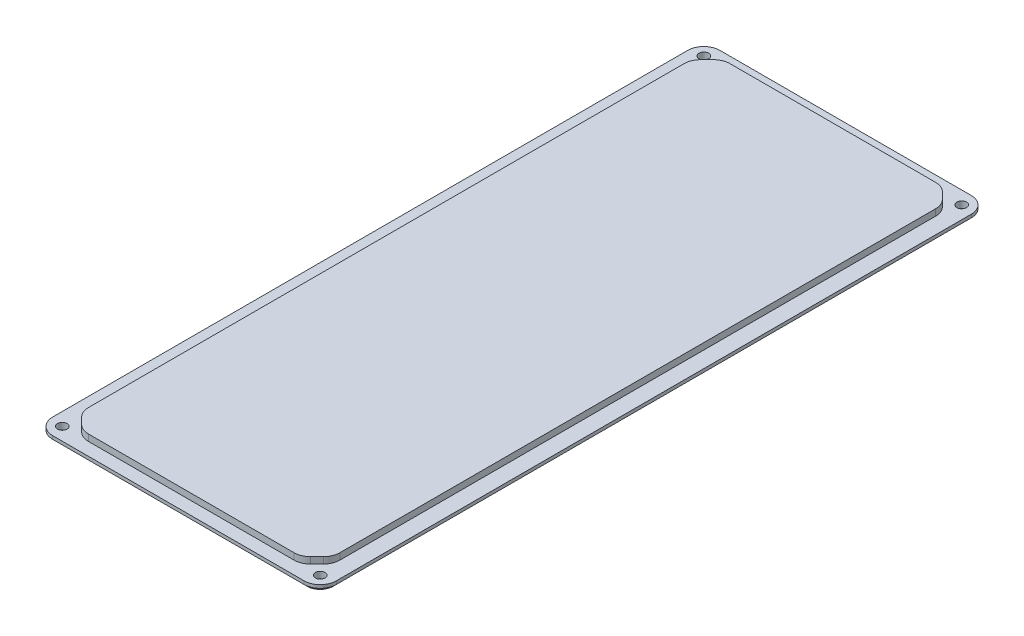
ISO-10303-21;
HEADER;
FILE_DESCRIPTION(('STEP AP214'),'2;1');
FILE_NAME('part.step','',(''),(''),'','','');
FILE_SCHEMA(('AUTOMOTIVE_DESIGN { 1 0 10303 214 1 1 1 1 }'));
ENDSEC;
DATA;
#1=APPLICATION_CONTEXT('core data for automotive mechanical design processes');
#2=APPLICATION_PROTOCOL_DEFINITION('international standard','automotive_design',2000,#1);
#3=PRODUCT_CONTEXT('',#1,'mechanical');
#4=PRODUCT('Part','Part','',(#3));
#5=PRODUCT_RELATED_PRODUCT_CATEGORY('part','',(#4));
#6=PRODUCT_DEFINITION_FORMATION('','',#4);
#7=PRODUCT_DEFINITION_CONTEXT('part definition',#1,'design');
#8=PRODUCT_DEFINITION('design','',#6,#7);
#9=PRODUCT_DEFINITION_SHAPE('','',#8);
#10=(LENGTH_UNIT() NAMED_UNIT(*) SI_UNIT(.MILLI.,.METRE.));
#11=(NAMED_UNIT(*) PLANE_ANGLE_UNIT() SI_UNIT($,.RADIAN.));
#12=(NAMED_UNIT(*) SI_UNIT($,.STERADIAN.) SOLID_ANGLE_UNIT());
#13=UNCERTAINTY_MEASURE_WITH_UNIT(LENGTH_MEASURE(1.E-05),#10,'distance_accuracy_value','');
#14=(GEOMETRIC_REPRESENTATION_CONTEXT(3) GLOBAL_UNCERTAINTY_ASSIGNED_CONTEXT((#13)) GLOBAL_UNIT_ASSIGNED_CONTEXT((#10,
#11,#12)) REPRESENTATION_CONTEXT('',''));
#15=CARTESIAN_POINT('',(0.,0.,0.));
#16=DIRECTION('',(0.,0.,1.));
#17=DIRECTION('',(1.,0.,0.));
#18=AXIS2_PLACEMENT_3D('',#15,#16,#17);
#19=CARTESIAN_POINT('',(0.,0.,0.));
#20=DIRECTION('',(0.,1.,0.));
#21=DIRECTION('',(0.,0.,1.));
#22=AXIS2_PLACEMENT_3D('',#19,#20,#21);
#23=PLANE('',#22);
#24=CARTESIAN_POINT('',(39.,0.,98.5));
#25=DIRECTION('',(0.,1.,0.));
#26=DIRECTION('',(0.,0.,1.));
#27=AXIS2_PLACEMENT_3D('',#24,#25,#26);
#28=CIRCLE('',#27,4.);
#29=CARTESIAN_POINT('',(43.,0.,98.5));
#30=VERTEX_POINT('',#29);
#31=CARTESIAN_POINT('',(39.,0.,102.5));
#32=VERTEX_POINT('',#31);
#33=EDGE_CURVE('E362',#30,#32,#28,.F.);
#34=ORIENTED_EDGE('',*,*,#33,.T.);
#35=DIRECTION('',(-1.,0.,0.));
#36=VECTOR('',#35,1.);
#37=CARTESIAN_POINT('',(0.,0.,102.5));
#38=LINE('',#37,#36);
#39=CARTESIAN_POINT('',(-39.,0.,102.5));
#40=VERTEX_POINT('',#39);
#41=EDGE_CURVE('E364',#32,#40,#38,.T.);
#42=ORIENTED_EDGE('',*,*,#41,.T.);
#43=CARTESIAN_POINT('',(-39.,0.,98.5));
#44=DIRECTION('',(0.,1.,0.));
#45=DIRECTION('',(0.,0.,1.));
#46=AXIS2_PLACEMENT_3D('',#43,#44,#45);
#47=CIRCLE('',#46,4.);
#48=CARTESIAN_POINT('',(-43.,0.,98.5));
#49=VERTEX_POINT('',#48);
#50=EDGE_CURVE('E360',#40,#49,#47,.F.);
#51=ORIENTED_EDGE('',*,*,#50,.T.);
#52=DIRECTION('',(0.,0.,-1.));
#53=VECTOR('',#52,1.);
#54=CARTESIAN_POINT('',(-43.,0.,0.));
#55=LINE('',#54,#53);
#56=CARTESIAN_POINT('',(-43.,0.,-98.5));
#57=VERTEX_POINT('',#56);
#58=EDGE_CURVE('E356',#49,#57,#55,.T.);
#59=ORIENTED_EDGE('',*,*,#58,.T.);
#60=CARTESIAN_POINT('',(-39.,0.,-98.5));
#61=DIRECTION('',(0.,1.,0.));
#62=DIRECTION('',(0.,0.,1.));
#63=AXIS2_PLACEMENT_3D('',#60,#61,#62);
#64=CIRCLE('',#63,4.);
#65=CARTESIAN_POINT('',(-39.,0.,-102.5));
#66=VERTEX_POINT('',#65);
#67=EDGE_CURVE('E352',#57,#66,#64,.F.);
#68=ORIENTED_EDGE('',*,*,#67,.T.);
#69=DIRECTION('',(1.,0.,0.));
#70=VECTOR('',#69,1.);
#71=CARTESIAN_POINT('',(0.,0.,-102.5));
#72=LINE('',#71,#70);
#73=CARTESIAN_POINT('',(39.,0.,-102.5));
#74=VERTEX_POINT('',#73);
#75=EDGE_CURVE('E350',#66,#74,#72,.T.);
#76=ORIENTED_EDGE('',*,*,#75,.T.);
#77=CARTESIAN_POINT('',(39.,0.,-98.5));
#78=DIRECTION('',(0.,1.,0.));
#79=DIRECTION('',(0.,0.,1.));
#80=AXIS2_PLACEMENT_3D('',#77,#78,#79);
#81=CIRCLE('',#80,4.);
#82=CARTESIAN_POINT('',(43.,0.,-98.5));
#83=VERTEX_POINT('',#82);
#84=EDGE_CURVE('E354',#74,#83,#81,.F.);
#85=ORIENTED_EDGE('',*,*,#84,.T.);
#86=DIRECTION('',(0.,0.,1.));
#87=VECTOR('',#86,1.);
#88=CARTESIAN_POINT('',(43.,0.,0.));
#89=LINE('',#88,#87);
#90=EDGE_CURVE('E358',#83,#30,#89,.T.);
#91=ORIENTED_EDGE('',*,*,#90,.T.);
#92=EDGE_LOOP('',(#34,#42,#51,#59,#68,#76,#85,#91));
#93=FACE_BOUND('',#92,.T.);
#94=CARTESIAN_POINT('',(-40.,0.,99.5));
#95=DIRECTION('',(0.,-1.,0.));
#96=DIRECTION('',(0.,0.,-1.));
#97=AXIS2_PLACEMENT_3D('',#94,#95,#96);
#98=CIRCLE('',#97,1.49999999999999);
#99=CARTESIAN_POINT('',(-40.,0.,98.));
#100=VERTEX_POINT('',#99);
#101=EDGE_CURVE('E416',#100,#100,#98,.T.);
#102=ORIENTED_EDGE('',*,*,#101,.F.);
#103=EDGE_LOOP('',(#102));
#104=FACE_BOUND('',#103,.T.);
#105=CARTESIAN_POINT('',(40.,0.,99.5));
#106=DIRECTION('',(0.,-1.,0.));
#107=DIRECTION('',(0.,0.,-1.));
#108=AXIS2_PLACEMENT_3D('',#105,#106,#107);
#109=CIRCLE('',#108,1.49999999999999);
#110=CARTESIAN_POINT('',(40.,0.,98.));
#111=VERTEX_POINT('',#110);
#112=EDGE_CURVE('E348',#111,#111,#109,.T.);
#113=ORIENTED_EDGE('',*,*,#112,.F.);
#114=EDGE_LOOP('',(#113));
#115=FACE_BOUND('',#114,.T.);
#116=CARTESIAN_POINT('',(-40.,0.,-99.5));
#117=DIRECTION('',(0.,-1.,0.));
#118=DIRECTION('',(0.,0.,-1.));
#119=AXIS2_PLACEMENT_3D('',#116,#117,#118);
#120=CIRCLE('',#119,1.49999999999999);
#121=CARTESIAN_POINT('',(-40.,0.,-101.));
#122=VERTEX_POINT('',#121);
#123=EDGE_CURVE('E408',#122,#122,#120,.T.);
#124=ORIENTED_EDGE('',*,*,#123,.F.);
#125=EDGE_LOOP('',(#124));
#126=FACE_BOUND('',#125,.T.);
#127=CARTESIAN_POINT('',(40.,0.,-99.5));
#128=DIRECTION('',(0.,-1.,0.));
#129=DIRECTION('',(0.,0.,-1.));
#130=AXIS2_PLACEMENT_3D('',#127,#128,#129);
#131=CIRCLE('',#130,1.49999999999999);
#132=CARTESIAN_POINT('',(40.,0.,-101.));
#133=VERTEX_POINT('',#132);
#134=EDGE_CURVE('E397',#133,#133,#131,.T.);
#135=ORIENTED_EDGE('',*,*,#134,.F.);
#136=EDGE_LOOP('',(#135));
#137=FACE_BOUND('',#136,.T.);
#138=ADVANCED_FACE('F33',(#93,#104,#115,#126,#137),#23,.F.);
#139=CARTESIAN_POINT('',(0.,2.,0.));
#140=DIRECTION('',(0.,1.,0.));
#141=DIRECTION('',(0.,0.,1.));
#142=AXIS2_PLACEMENT_3D('',#139,#140,#141);
#143=PLANE('',#142);
#144=CARTESIAN_POINT('',(40.,2.,-99.5));
#145=DIRECTION('',(0.,1.,0.));
#146=DIRECTION('',(0.,0.,1.));
#147=AXIS2_PLACEMENT_3D('',#144,#145,#146);
#148=CIRCLE('',#147,1.49999999999999);
#149=CARTESIAN_POINT('',(40.,2.,-98.));
#150=VERTEX_POINT('',#149);
#151=EDGE_CURVE('E403',#150,#150,#148,.T.);
#152=ORIENTED_EDGE('',*,*,#151,.F.);
#153=EDGE_LOOP('',(#152));
#154=FACE_BOUND('',#153,.T.);
#155=CARTESIAN_POINT('',(-40.,2.,-99.5));
#156=DIRECTION('',(0.,1.,0.));
#157=DIRECTION('',(0.,0.,1.));
#158=AXIS2_PLACEMENT_3D('',#155,#156,#157);
#159=CIRCLE('',#158,1.49999999999999);
#160=CARTESIAN_POINT('',(-40.,2.,-98.));
#161=VERTEX_POINT('',#160);
#162=EDGE_CURVE('E413',#161,#161,#159,.T.);
#163=ORIENTED_EDGE('',*,*,#162,.F.);
#164=EDGE_LOOP('',(#163));
#165=FACE_BOUND('',#164,.T.);
#166=CARTESIAN_POINT('',(-40.,2.,99.5));
#167=DIRECTION('',(0.,1.,0.));
#168=DIRECTION('',(0.,0.,1.));
#169=AXIS2_PLACEMENT_3D('',#166,#167,#168);
#170=CIRCLE('',#169,1.49999999999999);
#171=CARTESIAN_POINT('',(-40.,2.,101.));
#172=VERTEX_POINT('',#171);
#173=EDGE_CURVE('E419',#172,#172,#170,.T.);
#174=ORIENTED_EDGE('',*,*,#173,.F.);
#175=EDGE_LOOP('',(#174));
#176=FACE_BOUND('',#175,.T.);
#177=CARTESIAN_POINT('',(40.,2.,99.5));
#178=DIRECTION('',(0.,1.,0.));
#179=DIRECTION('',(0.,0.,1.));
#180=AXIS2_PLACEMENT_3D('',#177,#178,#179);
#181=CIRCLE('',#180,1.49999999999999);
#182=CARTESIAN_POINT('',(40.,2.,101.));
#183=VERTEX_POINT('',#182);
#184=EDGE_CURVE('E344',#183,#183,#181,.T.);
#185=ORIENTED_EDGE('',*,*,#184,.F.);
#186=EDGE_LOOP('',(#185));
#187=FACE_BOUND('',#186,.T.);
#188=DIRECTION('',(0.,0.,1.));
#189=VECTOR('',#188,1.);
#190=CARTESIAN_POINT('',(-44.,2.,-103.5));
#191=LINE('',#190,#189);
#192=CARTESIAN_POINT('',(-44.,2.,-98.5));
#193=VERTEX_POINT('',#192);
#194=CARTESIAN_POINT('',(-44.,2.,98.5));
#195=VERTEX_POINT('',#194);
#196=EDGE_CURVE('E228',#193,#195,#191,.T.);
#197=ORIENTED_EDGE('',*,*,#196,.T.);
#198=CARTESIAN_POINT('',(-39.,2.,98.5));
#199=DIRECTION('',(0.,1.,0.));
#200=DIRECTION('',(0.,0.,1.));
#201=AXIS2_PLACEMENT_3D('',#198,#199,#200);
#202=CIRCLE('',#201,5.);
#203=CARTESIAN_POINT('',(-39.,2.,103.5));
#204=VERTEX_POINT('',#203);
#205=EDGE_CURVE('E221',#195,#204,#202,.T.);
#206=ORIENTED_EDGE('',*,*,#205,.T.);
#207=DIRECTION('',(1.,0.,0.));
#208=VECTOR('',#207,1.);
#209=CARTESIAN_POINT('',(-44.,2.,103.5));
#210=LINE('',#209,#208);
#211=CARTESIAN_POINT('',(39.,2.,103.5));
#212=VERTEX_POINT('',#211);
#213=EDGE_CURVE('E225',#204,#212,#210,.T.);
#214=ORIENTED_EDGE('',*,*,#213,.T.);
#215=CARTESIAN_POINT('',(39.,2.,98.5));
#216=DIRECTION('',(0.,1.,0.));
#217=DIRECTION('',(0.,0.,1.));
#218=AXIS2_PLACEMENT_3D('',#215,#216,#217);
#219=CIRCLE('',#218,5.);
#220=CARTESIAN_POINT('',(44.,2.,98.5));
#221=VERTEX_POINT('',#220);
#222=EDGE_CURVE('E233',#212,#221,#219,.T.);
#223=ORIENTED_EDGE('',*,*,#222,.T.);
#224=DIRECTION('',(0.,0.,-1.));
#225=VECTOR('',#224,1.);
#226=CARTESIAN_POINT('',(44.,2.,-103.5));
#227=LINE('',#226,#225);
#228=CARTESIAN_POINT('',(44.,2.,-98.5));
#229=VERTEX_POINT('',#228);
#230=EDGE_CURVE('E437',#221,#229,#227,.T.);
#231=ORIENTED_EDGE('',*,*,#230,.T.);
#232=CARTESIAN_POINT('',(39.,2.,-98.5));
#233=DIRECTION('',(0.,1.,0.));
#234=DIRECTION('',(0.,0.,1.));
#235=AXIS2_PLACEMENT_3D('',#232,#233,#234);
#236=CIRCLE('',#235,5.);
#237=CARTESIAN_POINT('',(39.,2.,-103.5));
#238=VERTEX_POINT('',#237);
#239=EDGE_CURVE('E260',#229,#238,#236,.T.);
#240=ORIENTED_EDGE('',*,*,#239,.T.);
#241=DIRECTION('',(-1.,0.,0.));
#242=VECTOR('',#241,1.);
#243=CARTESIAN_POINT('',(-44.,2.,-103.5));
#244=LINE('',#243,#242);
#245=CARTESIAN_POINT('',(-39.,2.,-103.5));
#246=VERTEX_POINT('',#245);
#247=EDGE_CURVE('E450',#238,#246,#244,.T.);
#248=ORIENTED_EDGE('',*,*,#247,.T.);
#249=CARTESIAN_POINT('',(-39.,2.,-98.5));
#250=DIRECTION('',(0.,1.,0.));
#251=DIRECTION('',(0.,0.,1.));
#252=AXIS2_PLACEMENT_3D('',#249,#250,#251);
#253=CIRCLE('',#252,5.);
#254=EDGE_CURVE('E258',#246,#193,#253,.T.);
#255=ORIENTED_EDGE('',*,*,#254,.T.);
#256=EDGE_LOOP('',(#197,#206,#214,#223,#231,#240,#248,#255));
#257=FACE_BOUND('',#256,.T.);
#258=DIRECTION('',(-1.,0.,0.));
#259=VECTOR('',#258,1.);
#260=CARTESIAN_POINT('',(-39.,2.,-99.5));
#261=LINE('',#260,#259);
#262=CARTESIAN_POINT('',(31.9289321881346,2.,-99.5));
#263=VERTEX_POINT('',#262);
#264=CARTESIAN_POINT('',(-31.9289321881345,2.,-99.5));
#265=VERTEX_POINT('',#264);
#266=EDGE_CURVE('E440',#263,#265,#261,.T.);
#267=ORIENTED_EDGE('',*,*,#266,.F.);
#268=CARTESIAN_POINT('',(31.9289321881346,2.,-94.5));
#269=DIRECTION('',(0.,1.,0.));
#270=DIRECTION('',(0.,0.,1.));
#271=AXIS2_PLACEMENT_3D('',#268,#269,#270);
#272=CIRCLE('',#271,5.);
#273=CARTESIAN_POINT('',(35.4644660940673,2.,-98.0355339059327));
#274=VERTEX_POINT('',#273);
#275=EDGE_CURVE('E335',#263,#274,#272,.F.);
#276=ORIENTED_EDGE('',*,*,#275,.T.);
#277=DIRECTION('',(-0.707106781186546,0.,-0.707106781186549));
#278=VECTOR('',#277,1.);
#279=CARTESIAN_POINT('',(34.,2.,-99.5));
#280=LINE('',#279,#278);
#281=CARTESIAN_POINT('',(37.5355339059328,2.,-95.9644660940672));
#282=VERTEX_POINT('',#281);
#283=EDGE_CURVE('E468',#274,#282,#280,.F.);
#284=ORIENTED_EDGE('',*,*,#283,.T.);
#285=CARTESIAN_POINT('',(34.,2.,-92.4289321881345));
#286=DIRECTION('',(0.,1.,0.));
#287=DIRECTION('',(0.,0.,1.));
#288=AXIS2_PLACEMENT_3D('',#285,#286,#287);
#289=CIRCLE('',#288,5.);
#290=CARTESIAN_POINT('',(39.,2.,-92.4289321881345));
#291=VERTEX_POINT('',#290);
#292=EDGE_CURVE('E337',#282,#291,#289,.F.);
#293=ORIENTED_EDGE('',*,*,#292,.T.);
#294=DIRECTION('',(0.,0.,-1.));
#295=VECTOR('',#294,1.);
#296=CARTESIAN_POINT('',(39.,2.,-99.5));
#297=LINE('',#296,#295);
#298=CARTESIAN_POINT('',(39.,2.,92.4289321881345));
#299=VERTEX_POINT('',#298);
#300=EDGE_CURVE('E347',#299,#291,#297,.T.);
#301=ORIENTED_EDGE('',*,*,#300,.F.);
#302=CARTESIAN_POINT('',(34.,2.,92.4289321881345));
#303=DIRECTION('',(0.,1.,0.));
#304=DIRECTION('',(0.,0.,1.));
#305=AXIS2_PLACEMENT_3D('',#302,#303,#304);
#306=CIRCLE('',#305,5.);
#307=CARTESIAN_POINT('',(37.5355339059328,2.,95.9644660940673));
#308=VERTEX_POINT('',#307);
#309=EDGE_CURVE('E331',#299,#308,#306,.F.);
#310=ORIENTED_EDGE('',*,*,#309,.T.);
#311=DIRECTION('',(0.707106781186548,0.,-0.707106781186547));
#312=VECTOR('',#311,1.);
#313=CARTESIAN_POINT('',(39.,2.,94.5));
#314=LINE('',#313,#312);
#315=CARTESIAN_POINT('',(35.4644660940673,2.,98.0355339059327));
#316=VERTEX_POINT('',#315);
#317=EDGE_CURVE('E253',#308,#316,#314,.F.);
#318=ORIENTED_EDGE('',*,*,#317,.T.);
#319=CARTESIAN_POINT('',(31.9289321881345,2.,94.5));
#320=DIRECTION('',(0.,1.,0.));
#321=DIRECTION('',(0.,0.,1.));
#322=AXIS2_PLACEMENT_3D('',#319,#320,#321);
#323=CIRCLE('',#322,5.);
#324=CARTESIAN_POINT('',(31.9289321881345,2.,99.5));
#325=VERTEX_POINT('',#324);
#326=EDGE_CURVE('E333',#316,#325,#323,.F.);
#327=ORIENTED_EDGE('',*,*,#326,.T.);
#328=DIRECTION('',(1.,0.,0.));
#329=VECTOR('',#328,1.);
#330=CARTESIAN_POINT('',(-39.,2.,99.5));
#331=LINE('',#330,#329);
#332=CARTESIAN_POINT('',(-31.9289321881345,2.,99.5));
#333=VERTEX_POINT('',#332);
#334=EDGE_CURVE('E428',#333,#325,#331,.T.);
#335=ORIENTED_EDGE('',*,*,#334,.F.);
#336=CARTESIAN_POINT('',(-31.9289321881345,2.,94.5));
#337=DIRECTION('',(0.,1.,0.));
#338=DIRECTION('',(0.,0.,1.));
#339=AXIS2_PLACEMENT_3D('',#336,#337,#338);
#340=CIRCLE('',#339,5.);
#341=CARTESIAN_POINT('',(-35.4644660940673,2.,98.0355339059327));
#342=VERTEX_POINT('',#341);
#343=EDGE_CURVE('E329',#333,#342,#340,.F.);
#344=ORIENTED_EDGE('',*,*,#343,.T.);
#345=DIRECTION('',(0.707106781186546,0.,0.707106781186549));
#346=VECTOR('',#345,1.);
#347=CARTESIAN_POINT('',(-34.,2.,99.5));
#348=LINE('',#347,#346);
#349=CARTESIAN_POINT('',(-37.5355339059328,2.,95.9644660940672));
#350=VERTEX_POINT('',#349);
#351=EDGE_CURVE('E471',#342,#350,#348,.F.);
#352=ORIENTED_EDGE('',*,*,#351,.T.);
#353=CARTESIAN_POINT('',(-34.,2.,92.4289321881345));
#354=DIRECTION('',(0.,1.,0.));
#355=DIRECTION('',(0.,0.,1.));
#356=AXIS2_PLACEMENT_3D('',#353,#354,#355);
#357=CIRCLE('',#356,5.);
#358=CARTESIAN_POINT('',(-39.,2.,92.4289321881345));
#359=VERTEX_POINT('',#358);
#360=EDGE_CURVE('E327',#350,#359,#357,.F.);
#361=ORIENTED_EDGE('',*,*,#360,.T.);
#362=DIRECTION('',(0.,0.,1.));
#363=VECTOR('',#362,1.);
#364=CARTESIAN_POINT('',(-39.,2.,-99.5));
#365=LINE('',#364,#363);
#366=CARTESIAN_POINT('',(-39.,2.,-92.4289321881345));
#367=VERTEX_POINT('',#366);
#368=EDGE_CURVE('E443',#367,#359,#365,.T.);
#369=ORIENTED_EDGE('',*,*,#368,.F.);
#370=CARTESIAN_POINT('',(-34.,2.,-92.4289321881345));
#371=DIRECTION('',(0.,1.,0.));
#372=DIRECTION('',(0.,0.,1.));
#373=AXIS2_PLACEMENT_3D('',#370,#371,#372);
#374=CIRCLE('',#373,5.);
#375=CARTESIAN_POINT('',(-37.5355339059328,2.,-95.9644660940673));
#376=VERTEX_POINT('',#375);
#377=EDGE_CURVE('E341',#367,#376,#374,.F.);
#378=ORIENTED_EDGE('',*,*,#377,.T.);
#379=DIRECTION('',(-0.707106781186548,0.,0.707106781186548));
#380=VECTOR('',#379,1.);
#381=CARTESIAN_POINT('',(-39.,2.,-94.5));
#382=LINE('',#381,#380);
#383=CARTESIAN_POINT('',(-35.4644660940673,2.,-98.0355339059327));
#384=VERTEX_POINT('',#383);
#385=EDGE_CURVE('E465',#376,#384,#382,.F.);
#386=ORIENTED_EDGE('',*,*,#385,.T.);
#387=CARTESIAN_POINT('',(-31.9289321881345,2.,-94.5));
#388=DIRECTION('',(0.,1.,0.));
#389=DIRECTION('',(0.,0.,1.));
#390=AXIS2_PLACEMENT_3D('',#387,#388,#389);
#391=CIRCLE('',#390,5.);
#392=EDGE_CURVE('E339',#384,#265,#391,.F.);
#393=ORIENTED_EDGE('',*,*,#392,.T.);
#394=EDGE_LOOP('',(#267,#276,#284,#293,#301,#310,#318,#327,#335,#344,#352,#361,#369,#378,#386,#393));
#395=FACE_BOUND('',#394,.T.);
#396=ADVANCED_FACE('F223',(#154,#165,#176,#187,#257,#395),#143,.T.);
#397=CARTESIAN_POINT('',(44.,2.,-103.5));
#398=DIRECTION('',(-1.,0.,0.));
#399=DIRECTION('',(0.,0.,1.));
#400=AXIS2_PLACEMENT_3D('',#397,#398,#399);
#401=PLANE('',#400);
#402=DIRECTION('',(0.,-1.,0.));
#403=VECTOR('',#402,1.);
#404=CARTESIAN_POINT('',(44.,2.,98.5));
#405=LINE('',#404,#403);
#406=CARTESIAN_POINT('',(44.,1.,98.5));
#407=VERTEX_POINT('',#406);
#408=EDGE_CURVE('E296',#221,#407,#405,.T.);
#409=ORIENTED_EDGE('',*,*,#408,.T.);
#410=DIRECTION('',(0.,0.,-1.));
#411=VECTOR('',#410,1.);
#412=CARTESIAN_POINT('',(44.,1.,-103.5));
#413=LINE('',#412,#411);
#414=CARTESIAN_POINT('',(44.,1.,-98.5));
#415=VERTEX_POINT('',#414);
#416=EDGE_CURVE('E370',#407,#415,#413,.T.);
#417=ORIENTED_EDGE('',*,*,#416,.T.);
#418=DIRECTION('',(0.,-1.,0.));
#419=VECTOR('',#418,1.);
#420=CARTESIAN_POINT('',(44.,2.,-98.5));
#421=LINE('',#420,#419);
#422=EDGE_CURVE('E294',#415,#229,#421,.F.);
#423=ORIENTED_EDGE('',*,*,#422,.T.);
#424=ORIENTED_EDGE('',*,*,#230,.F.);
#425=EDGE_LOOP('',(#409,#417,#423,#424));
#426=FACE_BOUND('',#425,.T.);
#427=ADVANCED_FACE('F562',(#426),#401,.F.);
#428=CARTESIAN_POINT('',(-44.,2.,-103.5));
#429=DIRECTION('',(0.,0.,1.));
#430=DIRECTION('',(1.,0.,0.));
#431=AXIS2_PLACEMENT_3D('',#428,#429,#430);
#432=PLANE('',#431);
#433=DIRECTION('',(0.,-1.,0.));
#434=VECTOR('',#433,1.);
#435=CARTESIAN_POINT('',(39.,2.,-103.5));
#436=LINE('',#435,#434);
#437=CARTESIAN_POINT('',(39.,1.,-103.5));
#438=VERTEX_POINT('',#437);
#439=EDGE_CURVE('E311',#238,#438,#436,.T.);
#440=ORIENTED_EDGE('',*,*,#439,.T.);
#441=DIRECTION('',(-1.,0.,0.));
#442=VECTOR('',#441,1.);
#443=CARTESIAN_POINT('',(-44.,1.,-103.5));
#444=LINE('',#443,#442);
#445=CARTESIAN_POINT('',(-39.,1.,-103.5));
#446=VERTEX_POINT('',#445);
#447=EDGE_CURVE('E11',#438,#446,#444,.T.);
#448=ORIENTED_EDGE('',*,*,#447,.T.);
#449=DIRECTION('',(0.,-1.,0.));
#450=VECTOR('',#449,1.);
#451=CARTESIAN_POINT('',(-39.,2.,-103.5));
#452=LINE('',#451,#450);
#453=EDGE_CURVE('E309',#446,#246,#452,.F.);
#454=ORIENTED_EDGE('',*,*,#453,.T.);
#455=ORIENTED_EDGE('',*,*,#247,.F.);
#456=EDGE_LOOP('',(#440,#448,#454,#455));
#457=FACE_BOUND('',#456,.T.);
#458=ADVANCED_FACE('F573',(#457),#432,.F.);
#459=CARTESIAN_POINT('',(-44.,2.,-103.5));
#460=DIRECTION('',(1.,0.,0.));
#461=DIRECTION('',(0.,0.,-1.));
#462=AXIS2_PLACEMENT_3D('',#459,#460,#461);
#463=PLANE('',#462);
#464=DIRECTION('',(0.,-1.,0.));
#465=VECTOR('',#464,1.);
#466=CARTESIAN_POINT('',(-44.,2.,-98.5));
#467=LINE('',#466,#465);
#468=CARTESIAN_POINT('',(-44.,1.,-98.5));
#469=VERTEX_POINT('',#468);
#470=EDGE_CURVE('E248',#193,#469,#467,.T.);
#471=ORIENTED_EDGE('',*,*,#470,.T.);
#472=DIRECTION('',(0.,0.,1.));
#473=VECTOR('',#472,1.);
#474=CARTESIAN_POINT('',(-44.,1.,-103.5));
#475=LINE('',#474,#473);
#476=CARTESIAN_POINT('',(-44.,1.,98.5));
#477=VERTEX_POINT('',#476);
#478=EDGE_CURVE('E372',#469,#477,#475,.T.);
#479=ORIENTED_EDGE('',*,*,#478,.T.);
#480=DIRECTION('',(0.,-1.,0.));
#481=VECTOR('',#480,1.);
#482=CARTESIAN_POINT('',(-44.,2.,98.5));
#483=LINE('',#482,#481);
#484=EDGE_CURVE('E251',#477,#195,#483,.F.);
#485=ORIENTED_EDGE('',*,*,#484,.T.);
#486=ORIENTED_EDGE('',*,*,#196,.F.);
#487=EDGE_LOOP('',(#471,#479,#485,#486));
#488=FACE_BOUND('',#487,.T.);
#489=ADVANCED_FACE('F570',(#488),#463,.F.);
#490=CARTESIAN_POINT('',(-44.,2.,103.5));
#491=DIRECTION('',(0.,0.,-1.));
#492=DIRECTION('',(-1.,0.,0.));
#493=AXIS2_PLACEMENT_3D('',#490,#491,#492);
#494=PLANE('',#493);
#495=DIRECTION('',(0.,-1.,0.));
#496=VECTOR('',#495,1.);
#497=CARTESIAN_POINT('',(-39.,2.,103.5));
#498=LINE('',#497,#496);
#499=CARTESIAN_POINT('',(-39.,1.,103.5));
#500=VERTEX_POINT('',#499);
#501=EDGE_CURVE('E239',#204,#500,#498,.T.);
#502=ORIENTED_EDGE('',*,*,#501,.T.);
#503=DIRECTION('',(1.,0.,0.));
#504=VECTOR('',#503,1.);
#505=CARTESIAN_POINT('',(-44.,1.,103.5));
#506=LINE('',#505,#504);
#507=CARTESIAN_POINT('',(39.,1.,103.5));
#508=VERTEX_POINT('',#507);
#509=EDGE_CURVE('E343',#500,#508,#506,.T.);
#510=ORIENTED_EDGE('',*,*,#509,.T.);
#511=DIRECTION('',(0.,-1.,0.));
#512=VECTOR('',#511,1.);
#513=CARTESIAN_POINT('',(39.,2.,103.5));
#514=LINE('',#513,#512);
#515=EDGE_CURVE('E242',#508,#212,#514,.F.);
#516=ORIENTED_EDGE('',*,*,#515,.T.);
#517=ORIENTED_EDGE('',*,*,#213,.F.);
#518=EDGE_LOOP('',(#502,#510,#516,#517));
#519=FACE_BOUND('',#518,.T.);
#520=ADVANCED_FACE('F237',(#519),#494,.F.);
#521=CARTESIAN_POINT('',(39.,4.,-99.5));
#522=DIRECTION('',(-1.,0.,0.));
#523=DIRECTION('',(0.,0.,1.));
#524=AXIS2_PLACEMENT_3D('',#521,#522,#523);
#525=PLANE('',#524);
#526=DIRECTION('',(0.,0.,-1.));
#527=VECTOR('',#526,1.);
#528=CARTESIAN_POINT('',(39.,4.,-99.5));
#529=LINE('',#528,#527);
#530=CARTESIAN_POINT('',(39.,4.,92.4289321881345));
#531=VERTEX_POINT('',#530);
#532=CARTESIAN_POINT('',(39.,4.,-92.4289321881345));
#533=VERTEX_POINT('',#532);
#534=EDGE_CURVE('E424',#531,#533,#529,.T.);
#535=ORIENTED_EDGE('',*,*,#534,.F.);
#536=DIRECTION('',(0.,1.,0.));
#537=VECTOR('',#536,1.);
#538=CARTESIAN_POINT('',(39.,2.,92.4289321881345));
#539=LINE('',#538,#537);
#540=EDGE_CURVE('E302',#531,#299,#539,.F.);
#541=ORIENTED_EDGE('',*,*,#540,.T.);
#542=ORIENTED_EDGE('',*,*,#300,.T.);
#543=DIRECTION('',(0.,-1.,0.));
#544=VECTOR('',#543,1.);
#545=CARTESIAN_POINT('',(39.,4.,-92.4289321881345));
#546=LINE('',#545,#544);
#547=EDGE_CURVE('E299',#291,#533,#546,.F.);
#548=ORIENTED_EDGE('',*,*,#547,.T.);
#549=EDGE_LOOP('',(#535,#541,#542,#548));
#550=FACE_BOUND('',#549,.T.);
#551=ADVANCED_FACE('F542',(#550),#525,.F.);
#552=CARTESIAN_POINT('',(-39.,4.,-99.5));
#553=DIRECTION('',(0.,0.,1.));
#554=DIRECTION('',(1.,0.,0.));
#555=AXIS2_PLACEMENT_3D('',#552,#553,#554);
#556=PLANE('',#555);
#557=DIRECTION('',(-1.,0.,0.));
#558=VECTOR('',#557,1.);
#559=CARTESIAN_POINT('',(-39.,4.,-99.5));
#560=LINE('',#559,#558);
#561=CARTESIAN_POINT('',(31.9289321881346,4.,-99.5));
#562=VERTEX_POINT('',#561);
#563=CARTESIAN_POINT('',(-31.9289321881345,4.,-99.5));
#564=VERTEX_POINT('',#563);
#565=EDGE_CURVE('E427',#562,#564,#560,.T.);
#566=ORIENTED_EDGE('',*,*,#565,.F.);
#567=DIRECTION('',(0.,1.,0.));
#568=VECTOR('',#567,1.);
#569=CARTESIAN_POINT('',(31.9289321881346,2.,-99.5));
#570=LINE('',#569,#568);
#571=EDGE_CURVE('E316',#562,#263,#570,.F.);
#572=ORIENTED_EDGE('',*,*,#571,.T.);
#573=ORIENTED_EDGE('',*,*,#266,.T.);
#574=DIRECTION('',(0.,-1.,0.));
#575=VECTOR('',#574,1.);
#576=CARTESIAN_POINT('',(-31.9289321881345,4.,-99.5));
#577=LINE('',#576,#575);
#578=EDGE_CURVE('E313',#265,#564,#577,.F.);
#579=ORIENTED_EDGE('',*,*,#578,.T.);
#580=EDGE_LOOP('',(#566,#572,#573,#579));
#581=FACE_BOUND('',#580,.T.);
#582=ADVANCED_FACE('F525',(#581),#556,.F.);
#583=CARTESIAN_POINT('',(-39.,4.,-99.5));
#584=DIRECTION('',(1.,0.,0.));
#585=DIRECTION('',(0.,0.,-1.));
#586=AXIS2_PLACEMENT_3D('',#583,#584,#585);
#587=PLANE('',#586);
#588=ORIENTED_EDGE('',*,*,#368,.T.);
#589=DIRECTION('',(0.,-1.,0.));
#590=VECTOR('',#589,1.);
#591=CARTESIAN_POINT('',(-39.,4.,92.4289321881345));
#592=LINE('',#591,#590);
#593=CARTESIAN_POINT('',(-39.,4.,92.4289321881345));
#594=VERTEX_POINT('',#593);
#595=EDGE_CURVE('E265',#359,#594,#592,.F.);
#596=ORIENTED_EDGE('',*,*,#595,.T.);
#597=DIRECTION('',(0.,0.,1.));
#598=VECTOR('',#597,1.);
#599=CARTESIAN_POINT('',(-39.,4.,-99.5));
#600=LINE('',#599,#598);
#601=CARTESIAN_POINT('',(-39.,4.,-92.4289321881345));
#602=VERTEX_POINT('',#601);
#603=EDGE_CURVE('E431',#602,#594,#600,.T.);
#604=ORIENTED_EDGE('',*,*,#603,.F.);
#605=DIRECTION('',(0.,1.,0.));
#606=VECTOR('',#605,1.);
#607=CARTESIAN_POINT('',(-39.,2.,-92.4289321881345));
#608=LINE('',#607,#606);
#609=EDGE_CURVE('E232',#602,#367,#608,.F.);
#610=ORIENTED_EDGE('',*,*,#609,.T.);
#611=EDGE_LOOP('',(#588,#596,#604,#610));
#612=FACE_BOUND('',#611,.T.);
#613=ADVANCED_FACE('F507',(#612),#587,.F.);
#614=CARTESIAN_POINT('',(-39.,4.,99.5));
#615=DIRECTION('',(0.,0.,-1.));
#616=DIRECTION('',(-1.,0.,0.));
#617=AXIS2_PLACEMENT_3D('',#614,#615,#616);
#618=PLANE('',#617);
#619=DIRECTION('',(1.,0.,0.));
#620=VECTOR('',#619,1.);
#621=CARTESIAN_POINT('',(-39.,4.,99.5));
#622=LINE('',#621,#620);
#623=CARTESIAN_POINT('',(-31.9289321881345,4.,99.5));
#624=VERTEX_POINT('',#623);
#625=CARTESIAN_POINT('',(31.9289321881345,4.,99.5));
#626=VERTEX_POINT('',#625);
#627=EDGE_CURVE('E434',#624,#626,#622,.T.);
#628=ORIENTED_EDGE('',*,*,#627,.F.);
#629=DIRECTION('',(0.,1.,0.));
#630=VECTOR('',#629,1.);
#631=CARTESIAN_POINT('',(-31.9289321881345,2.,99.5));
#632=LINE('',#631,#630);
#633=EDGE_CURVE('E291',#624,#333,#632,.F.);
#634=ORIENTED_EDGE('',*,*,#633,.T.);
#635=ORIENTED_EDGE('',*,*,#334,.T.);
#636=DIRECTION('',(0.,-1.,0.));
#637=VECTOR('',#636,1.);
#638=CARTESIAN_POINT('',(31.9289321881345,4.,99.5));
#639=LINE('',#638,#637);
#640=EDGE_CURVE('E288',#325,#626,#639,.F.);
#641=ORIENTED_EDGE('',*,*,#640,.T.);
#642=EDGE_LOOP('',(#628,#634,#635,#641));
#643=FACE_BOUND('',#642,.T.);
#644=ADVANCED_FACE('F487',(#643),#618,.F.);
#645=CARTESIAN_POINT('',(0.,4.,0.));
#646=DIRECTION('',(0.,1.,0.));
#647=DIRECTION('',(0.,0.,1.));
#648=AXIS2_PLACEMENT_3D('',#645,#646,#647);
#649=PLANE('',#648);
#650=ORIENTED_EDGE('',*,*,#603,.T.);
#651=CARTESIAN_POINT('',(-34.,4.,92.4289321881345));
#652=DIRECTION('',(0.,1.,0.));
#653=DIRECTION('',(0.,0.,1.));
#654=AXIS2_PLACEMENT_3D('',#651,#652,#653);
#655=CIRCLE('',#654,5.);
#656=CARTESIAN_POINT('',(-37.5355339059328,4.,95.9644660940672));
#657=VERTEX_POINT('',#656);
#658=EDGE_CURVE('E282',#594,#657,#655,.T.);
#659=ORIENTED_EDGE('',*,*,#658,.T.);
#660=DIRECTION('',(-0.707106781186546,0.,-0.707106781186549));
#661=VECTOR('',#660,1.);
#662=CARTESIAN_POINT('',(-66.7500000000001,4.,66.7499999999997));
#663=LINE('',#662,#661);
#664=CARTESIAN_POINT('',(-35.4644660940673,4.,98.0355339059327));
#665=VERTEX_POINT('',#664);
#666=EDGE_CURVE('E456',#657,#665,#663,.F.);
#667=ORIENTED_EDGE('',*,*,#666,.T.);
#668=CARTESIAN_POINT('',(-31.9289321881345,4.,94.5));
#669=DIRECTION('',(0.,1.,0.));
#670=DIRECTION('',(0.,0.,1.));
#671=AXIS2_PLACEMENT_3D('',#668,#669,#670);
#672=CIRCLE('',#671,5.);
#673=EDGE_CURVE('E280',#665,#624,#672,.T.);
#674=ORIENTED_EDGE('',*,*,#673,.T.);
#675=ORIENTED_EDGE('',*,*,#627,.T.);
#676=CARTESIAN_POINT('',(31.9289321881345,4.,94.5));
#677=DIRECTION('',(0.,1.,0.));
#678=DIRECTION('',(0.,0.,1.));
#679=AXIS2_PLACEMENT_3D('',#676,#677,#678);
#680=CIRCLE('',#679,5.);
#681=CARTESIAN_POINT('',(35.4644660940673,4.,98.0355339059327));
#682=VERTEX_POINT('',#681);
#683=EDGE_CURVE('E276',#626,#682,#680,.T.);
#684=ORIENTED_EDGE('',*,*,#683,.T.);
#685=DIRECTION('',(-0.707106781186548,0.,0.707106781186547));
#686=VECTOR('',#685,1.);
#687=CARTESIAN_POINT('',(66.75,4.,66.7500000000001));
#688=LINE('',#687,#686);
#689=CARTESIAN_POINT('',(37.5355339059327,4.,95.9644660940672));
#690=VERTEX_POINT('',#689);
#691=EDGE_CURVE('E243',#682,#690,#688,.F.);
#692=ORIENTED_EDGE('',*,*,#691,.T.);
#693=CARTESIAN_POINT('',(34.,4.,92.4289321881345));
#694=DIRECTION('',(0.,1.,0.));
#695=DIRECTION('',(0.,0.,1.));
#696=AXIS2_PLACEMENT_3D('',#693,#694,#695);
#697=CIRCLE('',#696,5.);
#698=EDGE_CURVE('E278',#690,#531,#697,.T.);
#699=ORIENTED_EDGE('',*,*,#698,.T.);
#700=ORIENTED_EDGE('',*,*,#534,.T.);
#701=CARTESIAN_POINT('',(34.,4.,-92.4289321881345));
#702=DIRECTION('',(0.,1.,0.));
#703=DIRECTION('',(0.,0.,1.));
#704=AXIS2_PLACEMENT_3D('',#701,#702,#703);
#705=CIRCLE('',#704,5.);
#706=CARTESIAN_POINT('',(37.5355339059328,4.,-95.9644660940673));
#707=VERTEX_POINT('',#706);
#708=EDGE_CURVE('E272',#533,#707,#705,.T.);
#709=ORIENTED_EDGE('',*,*,#708,.T.);
#710=DIRECTION('',(0.707106781186546,0.,0.707106781186549));
#711=VECTOR('',#710,1.);
#712=CARTESIAN_POINT('',(66.7500000000001,4.,-66.7499999999998));
#713=LINE('',#712,#711);
#714=CARTESIAN_POINT('',(35.4644660940673,4.,-98.0355339059327));
#715=VERTEX_POINT('',#714);
#716=EDGE_CURVE('E459',#707,#715,#713,.F.);
#717=ORIENTED_EDGE('',*,*,#716,.T.);
#718=CARTESIAN_POINT('',(31.9289321881346,4.,-94.5));
#719=DIRECTION('',(0.,1.,0.));
#720=DIRECTION('',(0.,0.,1.));
#721=AXIS2_PLACEMENT_3D('',#718,#719,#720);
#722=CIRCLE('',#721,5.);
#723=EDGE_CURVE('E274',#715,#562,#722,.T.);
#724=ORIENTED_EDGE('',*,*,#723,.T.);
#725=ORIENTED_EDGE('',*,*,#565,.T.);
#726=CARTESIAN_POINT('',(-31.9289321881345,4.,-94.5));
#727=DIRECTION('',(0.,1.,0.));
#728=DIRECTION('',(0.,0.,1.));
#729=AXIS2_PLACEMENT_3D('',#726,#727,#728);
#730=CIRCLE('',#729,5.);
#731=CARTESIAN_POINT('',(-35.4644660940673,4.,-98.0355339059328));
#732=VERTEX_POINT('',#731);
#733=EDGE_CURVE('E270',#564,#732,#730,.T.);
#734=ORIENTED_EDGE('',*,*,#733,.T.);
#735=DIRECTION('',(0.707106781186548,0.,-0.707106781186548));
#736=VECTOR('',#735,1.);
#737=CARTESIAN_POINT('',(-66.75,4.,-66.75));
#738=LINE('',#737,#736);
#739=CARTESIAN_POINT('',(-37.5355339059328,4.,-95.9644660940673));
#740=VERTEX_POINT('',#739);
#741=EDGE_CURVE('E462',#732,#740,#738,.F.);
#742=ORIENTED_EDGE('',*,*,#741,.T.);
#743=CARTESIAN_POINT('',(-34.,4.,-92.4289321881345));
#744=DIRECTION('',(0.,1.,0.));
#745=DIRECTION('',(0.,0.,1.));
#746=AXIS2_PLACEMENT_3D('',#743,#744,#745);
#747=CIRCLE('',#746,5.);
#748=EDGE_CURVE('E268',#740,#602,#747,.T.);
#749=ORIENTED_EDGE('',*,*,#748,.T.);
#750=EDGE_LOOP('',(#650,#659,#667,#674,#675,#684,#692,#699,#700,#709,#717,#724,#725,#734,#742,#749));
#751=FACE_BOUND('',#750,.T.);
#752=ADVANCED_FACE('F490',(#751),#649,.T.);
#753=CARTESIAN_POINT('',(-39.,4.,-94.5));
#754=DIRECTION('',(0.707106781186547,0.,0.707106781186547));
#755=DIRECTION('',(0.,-1.,0.));
#756=AXIS2_PLACEMENT_3D('',#753,#754,#755);
#757=PLANE('',#756);
#758=ORIENTED_EDGE('',*,*,#741,.F.);
#759=DIRECTION('',(0.,1.,0.));
#760=VECTOR('',#759,1.);
#761=CARTESIAN_POINT('',(-35.4644660940673,2.,-98.0355339059327));
#762=LINE('',#761,#760);
#763=EDGE_CURVE('E325',#732,#384,#762,.F.);
#764=ORIENTED_EDGE('',*,*,#763,.T.);
#765=ORIENTED_EDGE('',*,*,#385,.F.);
#766=DIRECTION('',(0.,-1.,0.));
#767=VECTOR('',#766,1.);
#768=CARTESIAN_POINT('',(-37.5355339059328,4.,-95.9644660940673));
#769=LINE('',#768,#767);
#770=EDGE_CURVE('E323',#376,#740,#769,.F.);
#771=ORIENTED_EDGE('',*,*,#770,.T.);
#772=EDGE_LOOP('',(#758,#764,#765,#771));
#773=FACE_BOUND('',#772,.T.);
#774=ADVANCED_FACE('F518',(#773),#757,.F.);
#775=CARTESIAN_POINT('',(34.,4.,-99.5));
#776=DIRECTION('',(-0.707106781186549,0.,0.707106781186546));
#777=DIRECTION('',(0.,-1.,0.));
#778=AXIS2_PLACEMENT_3D('',#775,#776,#777);
#779=PLANE('',#778);
#780=ORIENTED_EDGE('',*,*,#283,.F.);
#781=DIRECTION('',(0.,-1.,0.));
#782=VECTOR('',#781,1.);
#783=CARTESIAN_POINT('',(35.4644660940673,4.,-98.0355339059327));
#784=LINE('',#783,#782);
#785=EDGE_CURVE('E321',#274,#715,#784,.F.);
#786=ORIENTED_EDGE('',*,*,#785,.T.);
#787=ORIENTED_EDGE('',*,*,#716,.F.);
#788=DIRECTION('',(0.,1.,0.));
#789=VECTOR('',#788,1.);
#790=CARTESIAN_POINT('',(37.5355339059328,2.,-95.9644660940672));
#791=LINE('',#790,#789);
#792=EDGE_CURVE('E319',#707,#282,#791,.F.);
#793=ORIENTED_EDGE('',*,*,#792,.T.);
#794=EDGE_LOOP('',(#780,#786,#787,#793));
#795=FACE_BOUND('',#794,.T.);
#796=ADVANCED_FACE('F534',(#795),#779,.F.);
#797=CARTESIAN_POINT('',(-34.,4.,99.5));
#798=DIRECTION('',(0.707106781186549,0.,-0.707106781186545));
#799=DIRECTION('',(0.,-1.,0.));
#800=AXIS2_PLACEMENT_3D('',#797,#798,#799);
#801=PLANE('',#800);
#802=ORIENTED_EDGE('',*,*,#666,.F.);
#803=DIRECTION('',(0.,1.,0.));
#804=VECTOR('',#803,1.);
#805=CARTESIAN_POINT('',(-37.5355339059328,2.,95.9644660940672));
#806=LINE('',#805,#804);
#807=EDGE_CURVE('E286',#657,#350,#806,.F.);
#808=ORIENTED_EDGE('',*,*,#807,.T.);
#809=ORIENTED_EDGE('',*,*,#351,.F.);
#810=DIRECTION('',(0.,-1.,0.));
#811=VECTOR('',#810,1.);
#812=CARTESIAN_POINT('',(-35.4644660940673,4.,98.0355339059327));
#813=LINE('',#812,#811);
#814=EDGE_CURVE('E284',#342,#665,#813,.F.);
#815=ORIENTED_EDGE('',*,*,#814,.T.);
#816=EDGE_LOOP('',(#802,#808,#809,#815));
#817=FACE_BOUND('',#816,.T.);
#818=ADVANCED_FACE('F500',(#817),#801,.F.);
#819=CARTESIAN_POINT('',(39.,4.,94.5));
#820=DIRECTION('',(-0.707106781186547,0.,-0.707106781186548));
#821=DIRECTION('',(0.,-1.,0.));
#822=AXIS2_PLACEMENT_3D('',#819,#820,#821);
#823=PLANE('',#822);
#824=ORIENTED_EDGE('',*,*,#317,.F.);
#825=DIRECTION('',(0.,-1.,0.));
#826=VECTOR('',#825,1.);
#827=CARTESIAN_POINT('',(37.5355339059328,4.,95.9644660940673));
#828=LINE('',#827,#826);
#829=EDGE_CURVE('E307',#308,#690,#828,.F.);
#830=ORIENTED_EDGE('',*,*,#829,.T.);
#831=ORIENTED_EDGE('',*,*,#691,.F.);
#832=DIRECTION('',(0.,1.,0.));
#833=VECTOR('',#832,1.);
#834=CARTESIAN_POINT('',(35.4644660940673,2.,98.0355339059327));
#835=LINE('',#834,#833);
#836=EDGE_CURVE('E305',#682,#316,#835,.F.);
#837=ORIENTED_EDGE('',*,*,#836,.T.);
#838=EDGE_LOOP('',(#824,#830,#831,#837));
#839=FACE_BOUND('',#838,.T.);
#840=ADVANCED_FACE('F547',(#839),#823,.F.);
#841=CARTESIAN_POINT('',(-39.,2.,98.5));
#842=DIRECTION('',(0.,-1.,0.));
#843=DIRECTION('',(0.,0.,-1.));
#844=AXIS2_PLACEMENT_3D('',#841,#842,#843);
#845=CYLINDRICAL_SURFACE('',#844,5.);
#846=ORIENTED_EDGE('',*,*,#484,.F.);
#847=CARTESIAN_POINT('',(-39.,1.,98.5));
#848=DIRECTION('',(0.,1.,0.));
#849=DIRECTION('',(0.,0.,1.));
#850=AXIS2_PLACEMENT_3D('',#847,#848,#849);
#851=CIRCLE('',#850,5.);
#852=EDGE_CURVE('E247',#477,#500,#851,.T.);
#853=ORIENTED_EDGE('',*,*,#852,.T.);
#854=ORIENTED_EDGE('',*,*,#501,.F.);
#855=ORIENTED_EDGE('',*,*,#205,.F.);
#856=EDGE_LOOP('',(#846,#853,#854,#855));
#857=FACE_BOUND('',#856,.T.);
#858=ADVANCED_FACE('F245',(#857),#845,.T.);
#859=CARTESIAN_POINT('',(-34.,4.,92.4289321881345));
#860=DIRECTION('',(0.,1.,0.));
#861=DIRECTION('',(0.,0.,1.));
#862=AXIS2_PLACEMENT_3D('',#859,#860,#861);
#863=CYLINDRICAL_SURFACE('',#862,5.);
#864=ORIENTED_EDGE('',*,*,#360,.F.);
#865=ORIENTED_EDGE('',*,*,#807,.F.);
#866=ORIENTED_EDGE('',*,*,#658,.F.);
#867=ORIENTED_EDGE('',*,*,#595,.F.);
#868=EDGE_LOOP('',(#864,#865,#866,#867));
#869=FACE_BOUND('',#868,.T.);
#870=ADVANCED_FACE('F503',(#869),#863,.T.);
#871=CARTESIAN_POINT('',(-31.9289321881345,4.,94.5));
#872=DIRECTION('',(0.,-1.,0.));
#873=DIRECTION('',(0.,0.,-1.));
#874=AXIS2_PLACEMENT_3D('',#871,#872,#873);
#875=CYLINDRICAL_SURFACE('',#874,5.);
#876=ORIENTED_EDGE('',*,*,#673,.F.);
#877=ORIENTED_EDGE('',*,*,#814,.F.);
#878=ORIENTED_EDGE('',*,*,#343,.F.);
#879=ORIENTED_EDGE('',*,*,#633,.F.);
#880=EDGE_LOOP('',(#876,#877,#878,#879));
#881=FACE_BOUND('',#880,.T.);
#882=ADVANCED_FACE('F496',(#881),#875,.T.);
#883=CARTESIAN_POINT('',(39.,2.,98.5));
#884=DIRECTION('',(0.,-1.,0.));
#885=DIRECTION('',(0.,0.,-1.));
#886=AXIS2_PLACEMENT_3D('',#883,#884,#885);
#887=CYLINDRICAL_SURFACE('',#886,5.);
#888=ORIENTED_EDGE('',*,*,#515,.F.);
#889=CARTESIAN_POINT('',(39.,1.,98.5));
#890=DIRECTION('',(0.,1.,0.));
#891=DIRECTION('',(0.,0.,1.));
#892=AXIS2_PLACEMENT_3D('',#889,#890,#891);
#893=CIRCLE('',#892,5.);
#894=EDGE_CURVE('E367',#508,#407,#893,.T.);
#895=ORIENTED_EDGE('',*,*,#894,.T.);
#896=ORIENTED_EDGE('',*,*,#408,.F.);
#897=ORIENTED_EDGE('',*,*,#222,.F.);
#898=EDGE_LOOP('',(#888,#895,#896,#897));
#899=FACE_BOUND('',#898,.T.);
#900=ADVANCED_FACE('F614',(#899),#887,.T.);
#901=CARTESIAN_POINT('',(34.,4.,92.4289321881345));
#902=DIRECTION('',(0.,-1.,0.));
#903=DIRECTION('',(0.,0.,-1.));
#904=AXIS2_PLACEMENT_3D('',#901,#902,#903);
#905=CYLINDRICAL_SURFACE('',#904,5.);
#906=ORIENTED_EDGE('',*,*,#698,.F.);
#907=ORIENTED_EDGE('',*,*,#829,.F.);
#908=ORIENTED_EDGE('',*,*,#309,.F.);
#909=ORIENTED_EDGE('',*,*,#540,.F.);
#910=EDGE_LOOP('',(#906,#907,#908,#909));
#911=FACE_BOUND('',#910,.T.);
#912=ADVANCED_FACE('F546',(#911),#905,.T.);
#913=CARTESIAN_POINT('',(31.9289321881345,4.,94.5));
#914=DIRECTION('',(0.,1.,0.));
#915=DIRECTION('',(0.,0.,1.));
#916=AXIS2_PLACEMENT_3D('',#913,#914,#915);
#917=CYLINDRICAL_SURFACE('',#916,5.);
#918=ORIENTED_EDGE('',*,*,#326,.F.);
#919=ORIENTED_EDGE('',*,*,#836,.F.);
#920=ORIENTED_EDGE('',*,*,#683,.F.);
#921=ORIENTED_EDGE('',*,*,#640,.F.);
#922=EDGE_LOOP('',(#918,#919,#920,#921));
#923=FACE_BOUND('',#922,.T.);
#924=ADVANCED_FACE('F484',(#923),#917,.T.);
#925=CARTESIAN_POINT('',(39.,2.,-98.5));
#926=DIRECTION('',(0.,-1.,0.));
#927=DIRECTION('',(0.,0.,-1.));
#928=AXIS2_PLACEMENT_3D('',#925,#926,#927);
#929=CYLINDRICAL_SURFACE('',#928,5.);
#930=ORIENTED_EDGE('',*,*,#422,.F.);
#931=CARTESIAN_POINT('',(39.,1.,-98.5));
#932=DIRECTION('',(0.,1.,0.));
#933=DIRECTION('',(0.,0.,1.));
#934=AXIS2_PLACEMENT_3D('',#931,#932,#933);
#935=CIRCLE('',#934,5.);
#936=EDGE_CURVE('E56',#415,#438,#935,.T.);
#937=ORIENTED_EDGE('',*,*,#936,.T.);
#938=ORIENTED_EDGE('',*,*,#439,.F.);
#939=ORIENTED_EDGE('',*,*,#239,.F.);
#940=EDGE_LOOP('',(#930,#937,#938,#939));
#941=FACE_BOUND('',#940,.T.);
#942=ADVANCED_FACE('F633',(#941),#929,.T.);
#943=CARTESIAN_POINT('',(31.9289321881346,4.,-94.5));
#944=DIRECTION('',(0.,-1.,0.));
#945=DIRECTION('',(0.,0.,-1.));
#946=AXIS2_PLACEMENT_3D('',#943,#944,#945);
#947=CYLINDRICAL_SURFACE('',#946,5.);
#948=ORIENTED_EDGE('',*,*,#723,.F.);
#949=ORIENTED_EDGE('',*,*,#785,.F.);
#950=ORIENTED_EDGE('',*,*,#275,.F.);
#951=ORIENTED_EDGE('',*,*,#571,.F.);
#952=EDGE_LOOP('',(#948,#949,#950,#951));
#953=FACE_BOUND('',#952,.T.);
#954=ADVANCED_FACE('F529',(#953),#947,.T.);
#955=CARTESIAN_POINT('',(34.,4.,-92.4289321881345));
#956=DIRECTION('',(0.,1.,0.));
#957=DIRECTION('',(0.,0.,1.));
#958=AXIS2_PLACEMENT_3D('',#955,#956,#957);
#959=CYLINDRICAL_SURFACE('',#958,5.);
#960=ORIENTED_EDGE('',*,*,#292,.F.);
#961=ORIENTED_EDGE('',*,*,#792,.F.);
#962=ORIENTED_EDGE('',*,*,#708,.F.);
#963=ORIENTED_EDGE('',*,*,#547,.F.);
#964=EDGE_LOOP('',(#960,#961,#962,#963));
#965=FACE_BOUND('',#964,.T.);
#966=ADVANCED_FACE('F538',(#965),#959,.T.);
#967=CARTESIAN_POINT('',(-31.9289321881345,4.,-94.5));
#968=DIRECTION('',(0.,1.,0.));
#969=DIRECTION('',(0.,0.,1.));
#970=AXIS2_PLACEMENT_3D('',#967,#968,#969);
#971=CYLINDRICAL_SURFACE('',#970,5.);
#972=ORIENTED_EDGE('',*,*,#392,.F.);
#973=ORIENTED_EDGE('',*,*,#763,.F.);
#974=ORIENTED_EDGE('',*,*,#733,.F.);
#975=ORIENTED_EDGE('',*,*,#578,.F.);
#976=EDGE_LOOP('',(#972,#973,#974,#975));
#977=FACE_BOUND('',#976,.T.);
#978=ADVANCED_FACE('F521',(#977),#971,.T.);
#979=CARTESIAN_POINT('',(-34.,4.,-92.4289321881345));
#980=DIRECTION('',(0.,-1.,0.));
#981=DIRECTION('',(0.,0.,-1.));
#982=AXIS2_PLACEMENT_3D('',#979,#980,#981);
#983=CYLINDRICAL_SURFACE('',#982,5.);
#984=ORIENTED_EDGE('',*,*,#748,.F.);
#985=ORIENTED_EDGE('',*,*,#770,.F.);
#986=ORIENTED_EDGE('',*,*,#377,.F.);
#987=ORIENTED_EDGE('',*,*,#609,.F.);
#988=EDGE_LOOP('',(#984,#985,#986,#987));
#989=FACE_BOUND('',#988,.T.);
#990=ADVANCED_FACE('F512',(#989),#983,.T.);
#991=CARTESIAN_POINT('',(-39.,2.,-98.5));
#992=DIRECTION('',(0.,-1.,0.));
#993=DIRECTION('',(0.,0.,-1.));
#994=AXIS2_PLACEMENT_3D('',#991,#992,#993);
#995=CYLINDRICAL_SURFACE('',#994,5.);
#996=ORIENTED_EDGE('',*,*,#453,.F.);
#997=CARTESIAN_POINT('',(-39.,1.,-98.5));
#998=DIRECTION('',(0.,1.,0.));
#999=DIRECTION('',(0.,0.,1.));
#1000=AXIS2_PLACEMENT_3D('',#997,#998,#999);
#1001=CIRCLE('',#1000,5.);
#1002=EDGE_CURVE('E42',#446,#469,#1001,.T.);
#1003=ORIENTED_EDGE('',*,*,#1002,.T.);
#1004=ORIENTED_EDGE('',*,*,#470,.F.);
#1005=ORIENTED_EDGE('',*,*,#254,.F.);
#1006=EDGE_LOOP('',(#996,#1003,#1004,#1005));
#1007=FACE_BOUND('',#1006,.T.);
#1008=ADVANCED_FACE('F668',(#1007),#995,.T.);
#1009=CARTESIAN_POINT('',(40.,0.,99.5));
#1010=DIRECTION('',(0.,-1.,0.));
#1011=DIRECTION('',(0.,0.,-1.));
#1012=AXIS2_PLACEMENT_3D('',#1009,#1010,#1011);
#1013=CYLINDRICAL_SURFACE('',#1012,1.49999999999999);
#1014=ORIENTED_EDGE('',*,*,#184,.T.);
#1015=EDGE_LOOP('',(#1014));
#1016=FACE_BOUND('',#1015,.T.);
#1017=ORIENTED_EDGE('',*,*,#112,.T.);
#1018=EDGE_LOOP('',(#1017));
#1019=FACE_BOUND('',#1018,.T.);
#1020=ADVANCED_FACE('F683',(#1016,#1019),#1013,.F.);
#1021=CARTESIAN_POINT('',(-40.,0.,99.5));
#1022=DIRECTION('',(0.,-1.,0.));
#1023=DIRECTION('',(0.,0.,-1.));
#1024=AXIS2_PLACEMENT_3D('',#1021,#1022,#1023);
#1025=CYLINDRICAL_SURFACE('',#1024,1.49999999999999);
#1026=ORIENTED_EDGE('',*,*,#173,.T.);
#1027=EDGE_LOOP('',(#1026));
#1028=FACE_BOUND('',#1027,.T.);
#1029=ORIENTED_EDGE('',*,*,#101,.T.);
#1030=EDGE_LOOP('',(#1029));
#1031=FACE_BOUND('',#1030,.T.);
#1032=ADVANCED_FACE('F688',(#1028,#1031),#1025,.F.);
#1033=CARTESIAN_POINT('',(-40.,0.,-99.5));
#1034=DIRECTION('',(0.,-1.,0.));
#1035=DIRECTION('',(0.,0.,-1.));
#1036=AXIS2_PLACEMENT_3D('',#1033,#1034,#1035);
#1037=CYLINDRICAL_SURFACE('',#1036,1.49999999999999);
#1038=ORIENTED_EDGE('',*,*,#162,.T.);
#1039=EDGE_LOOP('',(#1038));
#1040=FACE_BOUND('',#1039,.T.);
#1041=ORIENTED_EDGE('',*,*,#123,.T.);
#1042=EDGE_LOOP('',(#1041));
#1043=FACE_BOUND('',#1042,.T.);
#1044=ADVANCED_FACE('F699',(#1040,#1043),#1037,.F.);
#1045=CARTESIAN_POINT('',(40.,0.,-99.5));
#1046=DIRECTION('',(0.,-1.,0.));
#1047=DIRECTION('',(0.,0.,-1.));
#1048=AXIS2_PLACEMENT_3D('',#1045,#1046,#1047);
#1049=CYLINDRICAL_SURFACE('',#1048,1.49999999999999);
#1050=ORIENTED_EDGE('',*,*,#151,.T.);
#1051=EDGE_LOOP('',(#1050));
#1052=FACE_BOUND('',#1051,.T.);
#1053=ORIENTED_EDGE('',*,*,#134,.T.);
#1054=EDGE_LOOP('',(#1053));
#1055=FACE_BOUND('',#1054,.T.);
#1056=ADVANCED_FACE('F709',(#1052,#1055),#1049,.F.);
#1057=CARTESIAN_POINT('',(-44.,1.,-103.5));
#1058=DIRECTION('',(0.,0.707106781186547,0.707106781186547));
#1059=DIRECTION('',(-1.,0.,0.));
#1060=AXIS2_PLACEMENT_3D('',#1057,#1058,#1059);
#1061=PLANE('',#1060);
#1062=DIRECTION('',(0.,0.707106781186547,-0.707106781186547));
#1063=VECTOR('',#1062,1.);
#1064=CARTESIAN_POINT('',(39.,0.,-102.5));
#1065=LINE('',#1064,#1063);
#1066=EDGE_CURVE('E391',#74,#438,#1065,.T.);
#1067=ORIENTED_EDGE('',*,*,#1066,.F.);
#1068=ORIENTED_EDGE('',*,*,#75,.F.);
#1069=DIRECTION('',(0.,-0.707106781186547,0.707106781186547));
#1070=VECTOR('',#1069,1.);
#1071=CARTESIAN_POINT('',(-39.,1.,-103.5));
#1072=LINE('',#1071,#1070);
#1073=EDGE_CURVE('E37',#446,#66,#1072,.T.);
#1074=ORIENTED_EDGE('',*,*,#1073,.F.);
#1075=ORIENTED_EDGE('',*,*,#447,.F.);
#1076=EDGE_LOOP('',(#1067,#1068,#1074,#1075));
#1077=FACE_BOUND('',#1076,.T.);
#1078=ADVANCED_FACE('F35',(#1077),#1061,.F.);
#1079=CARTESIAN_POINT('',(-39.,0.,-98.5));
#1080=DIRECTION('',(0.,1.,0.));
#1081=DIRECTION('',(0.,0.,1.));
#1082=AXIS2_PLACEMENT_3D('',#1079,#1080,#1081);
#1083=CONICAL_SURFACE('',#1082,4.,0.785398163397446);
#1084=ORIENTED_EDGE('',*,*,#1073,.T.);
#1085=ORIENTED_EDGE('',*,*,#67,.F.);
#1086=DIRECTION('',(0.707106781186545,-0.70710678118655,0.));
#1087=VECTOR('',#1086,1.);
#1088=CARTESIAN_POINT('',(-44.,1.,-98.5));
#1089=LINE('',#1088,#1087);
#1090=EDGE_CURVE('E389',#469,#57,#1089,.T.);
#1091=ORIENTED_EDGE('',*,*,#1090,.F.);
#1092=ORIENTED_EDGE('',*,*,#1002,.F.);
#1093=EDGE_LOOP('',(#1084,#1085,#1091,#1092));
#1094=FACE_BOUND('',#1093,.T.);
#1095=ADVANCED_FACE('F780',(#1094),#1083,.T.);
#1096=CARTESIAN_POINT('',(39.,0.,-98.5));
#1097=DIRECTION('',(0.,1.,0.));
#1098=DIRECTION('',(0.,0.,1.));
#1099=AXIS2_PLACEMENT_3D('',#1096,#1097,#1098);
#1100=CONICAL_SURFACE('',#1099,4.,0.78539816339745);
#1101=ORIENTED_EDGE('',*,*,#1066,.T.);
#1102=ORIENTED_EDGE('',*,*,#936,.F.);
#1103=DIRECTION('',(0.707106781186547,0.707106781186547,0.));
#1104=VECTOR('',#1103,1.);
#1105=CARTESIAN_POINT('',(43.,0.,-98.5));
#1106=LINE('',#1105,#1104);
#1107=EDGE_CURVE('E386',#83,#415,#1106,.T.);
#1108=ORIENTED_EDGE('',*,*,#1107,.F.);
#1109=ORIENTED_EDGE('',*,*,#84,.F.);
#1110=EDGE_LOOP('',(#1101,#1102,#1108,#1109));
#1111=FACE_BOUND('',#1110,.T.);
#1112=ADVANCED_FACE('F789',(#1111),#1100,.T.);
#1113=CARTESIAN_POINT('',(-44.,1.,-103.5));
#1114=DIRECTION('',(0.707106781186547,0.707106781186547,0.));
#1115=DIRECTION('',(0.,0.,1.));
#1116=AXIS2_PLACEMENT_3D('',#1113,#1114,#1115);
#1117=PLANE('',#1116);
#1118=ORIENTED_EDGE('',*,*,#1090,.T.);
#1119=ORIENTED_EDGE('',*,*,#58,.F.);
#1120=DIRECTION('',(0.707106781186547,-0.707106781186547,0.));
#1121=VECTOR('',#1120,1.);
#1122=CARTESIAN_POINT('',(-44.,1.,98.5));
#1123=LINE('',#1122,#1121);
#1124=EDGE_CURVE('E383',#477,#49,#1123,.T.);
#1125=ORIENTED_EDGE('',*,*,#1124,.F.);
#1126=ORIENTED_EDGE('',*,*,#478,.F.);
#1127=EDGE_LOOP('',(#1118,#1119,#1125,#1126));
#1128=FACE_BOUND('',#1127,.T.);
#1129=ADVANCED_FACE('F797',(#1128),#1117,.F.);
#1130=CARTESIAN_POINT('',(44.,1.,-103.5));
#1131=DIRECTION('',(-0.707106781186549,0.707106781186546,0.));
#1132=DIRECTION('',(0.,0.,-1.));
#1133=AXIS2_PLACEMENT_3D('',#1130,#1131,#1132);
#1134=PLANE('',#1133);
#1135=ORIENTED_EDGE('',*,*,#1107,.T.);
#1136=ORIENTED_EDGE('',*,*,#416,.F.);
#1137=DIRECTION('',(0.707106781186547,0.707106781186547,0.));
#1138=VECTOR('',#1137,1.);
#1139=CARTESIAN_POINT('',(43.,0.,98.5));
#1140=LINE('',#1139,#1138);
#1141=EDGE_CURVE('E380',#30,#407,#1140,.T.);
#1142=ORIENTED_EDGE('',*,*,#1141,.F.);
#1143=ORIENTED_EDGE('',*,*,#90,.F.);
#1144=EDGE_LOOP('',(#1135,#1136,#1142,#1143));
#1145=FACE_BOUND('',#1144,.T.);
#1146=ADVANCED_FACE('F806',(#1145),#1134,.F.);
#1147=CARTESIAN_POINT('',(-39.,0.,98.5));
#1148=DIRECTION('',(0.,1.,0.));
#1149=DIRECTION('',(0.,0.,1.));
#1150=AXIS2_PLACEMENT_3D('',#1147,#1148,#1149);
#1151=CONICAL_SURFACE('',#1150,4.,0.78539816339745);
#1152=ORIENTED_EDGE('',*,*,#1124,.T.);
#1153=ORIENTED_EDGE('',*,*,#50,.F.);
#1154=DIRECTION('',(0.,-0.707106781186547,-0.707106781186547));
#1155=VECTOR('',#1154,1.);
#1156=CARTESIAN_POINT('',(-39.,1.,103.5));
#1157=LINE('',#1156,#1155);
#1158=EDGE_CURVE('E378',#500,#40,#1157,.T.);
#1159=ORIENTED_EDGE('',*,*,#1158,.F.);
#1160=ORIENTED_EDGE('',*,*,#852,.F.);
#1161=EDGE_LOOP('',(#1152,#1153,#1159,#1160));
#1162=FACE_BOUND('',#1161,.T.);
#1163=ADVANCED_FACE('F816',(#1162),#1151,.T.);
#1164=CARTESIAN_POINT('',(39.,0.,98.5));
#1165=DIRECTION('',(0.,1.,0.));
#1166=DIRECTION('',(0.,0.,1.));
#1167=AXIS2_PLACEMENT_3D('',#1164,#1165,#1166);
#1168=CONICAL_SURFACE('',#1167,4.,0.785398163397446);
#1169=ORIENTED_EDGE('',*,*,#1141,.T.);
#1170=ORIENTED_EDGE('',*,*,#894,.F.);
#1171=DIRECTION('',(0.,0.707106781186547,0.707106781186548));
#1172=VECTOR('',#1171,1.);
#1173=CARTESIAN_POINT('',(39.,0.,102.5));
#1174=LINE('',#1173,#1172);
#1175=EDGE_CURVE('E376',#32,#508,#1174,.T.);
#1176=ORIENTED_EDGE('',*,*,#1175,.F.);
#1177=ORIENTED_EDGE('',*,*,#33,.F.);
#1178=EDGE_LOOP('',(#1169,#1170,#1176,#1177));
#1179=FACE_BOUND('',#1178,.T.);
#1180=ADVANCED_FACE('F826',(#1179),#1168,.T.);
#1181=CARTESIAN_POINT('',(-44.,1.,103.5));
#1182=DIRECTION('',(0.,0.707106781186547,-0.707106781186547));
#1183=DIRECTION('',(1.,0.,0.));
#1184=AXIS2_PLACEMENT_3D('',#1181,#1182,#1183);
#1185=PLANE('',#1184);
#1186=ORIENTED_EDGE('',*,*,#1158,.T.);
#1187=ORIENTED_EDGE('',*,*,#41,.F.);
#1188=ORIENTED_EDGE('',*,*,#1175,.T.);
#1189=ORIENTED_EDGE('',*,*,#509,.F.);
#1190=EDGE_LOOP('',(#1186,#1187,#1188,#1189));
#1191=FACE_BOUND('',#1190,.T.);
#1192=ADVANCED_FACE('F836',(#1191),#1185,.F.);
#1193=CLOSED_SHELL('',(#138,#396,#427,#458,#489,#520,#551,#582,#613,#644,#752,#774,#796,#818,
#840,#858,#870,#882,#900,#912,#924,#942,#954,#966,#978,#990,#1008,#1020,#1032,#1044,#1056,#1078,
#1095,#1112,#1129,#1146,#1163,#1180,#1192));
#1194=MANIFOLD_SOLID_BREP('B2',#1193);
#1195=ADVANCED_BREP_SHAPE_REPRESENTATION('',(#18,#1194),#14);
#1196=SHAPE_DEFINITION_REPRESENTATION(#9,#1195);
ENDSEC;
END-ISO-10303-21;
